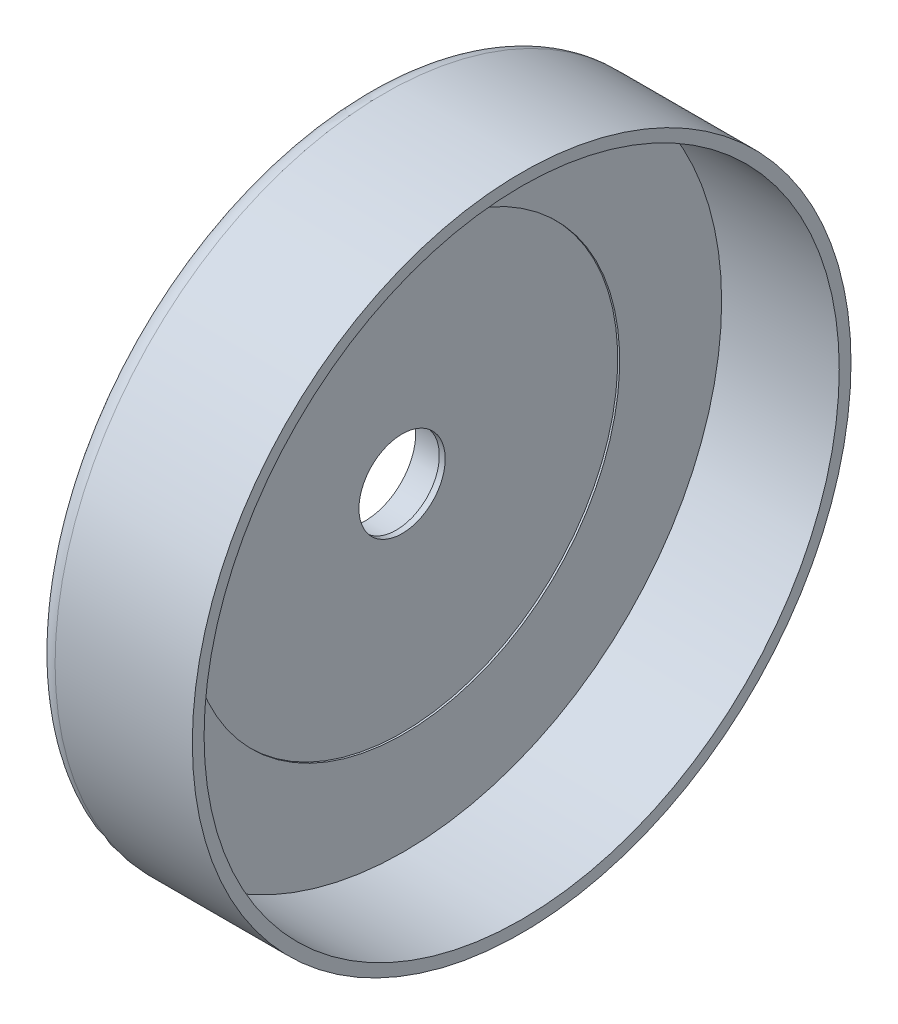
ISO-10303-21;
HEADER;
FILE_DESCRIPTION(('STEP AP214'),'2;1');
FILE_NAME('part.step','',(''),(''),'','','');
FILE_SCHEMA(('AUTOMOTIVE_DESIGN { 1 0 10303 214 1 1 1 1 }'));
ENDSEC;
DATA;
#1=APPLICATION_CONTEXT('core data for automotive mechanical design processes');
#2=APPLICATION_PROTOCOL_DEFINITION('international standard','automotive_design',2000,#1);
#3=PRODUCT_CONTEXT('',#1,'mechanical');
#4=PRODUCT('Part','Part','',(#3));
#5=PRODUCT_RELATED_PRODUCT_CATEGORY('part','',(#4));
#6=PRODUCT_DEFINITION_FORMATION('','',#4);
#7=PRODUCT_DEFINITION_CONTEXT('part definition',#1,'design');
#8=PRODUCT_DEFINITION('design','',#6,#7);
#9=PRODUCT_DEFINITION_SHAPE('','',#8);
#10=(LENGTH_UNIT() NAMED_UNIT(*) SI_UNIT(.MILLI.,.METRE.));
#11=(NAMED_UNIT(*) PLANE_ANGLE_UNIT() SI_UNIT($,.RADIAN.));
#12=(NAMED_UNIT(*) SI_UNIT($,.STERADIAN.) SOLID_ANGLE_UNIT());
#13=UNCERTAINTY_MEASURE_WITH_UNIT(LENGTH_MEASURE(1.E-05),#10,'distance_accuracy_value','');
#14=(GEOMETRIC_REPRESENTATION_CONTEXT(3) GLOBAL_UNCERTAINTY_ASSIGNED_CONTEXT((#13)) GLOBAL_UNIT_ASSIGNED_CONTEXT((#10,
#11,#12)) REPRESENTATION_CONTEXT('',''));
#15=CARTESIAN_POINT('',(0.,0.,0.));
#16=DIRECTION('',(0.,0.,1.));
#17=DIRECTION('',(1.,0.,0.));
#18=AXIS2_PLACEMENT_3D('',#15,#16,#17);
#19=CARTESIAN_POINT('',(30.,0.,0.));
#20=DIRECTION('',(-1.,0.,0.));
#21=DIRECTION('',(0.,0.,1.));
#22=AXIS2_PLACEMENT_3D('',#19,#20,#21);
#23=CYLINDRICAL_SURFACE('',#22,11.);
#24=CARTESIAN_POINT('',(-0.5,0.,0.));
#25=DIRECTION('',(1.,0.,0.));
#26=DIRECTION('',(0.,0.,-1.));
#27=AXIS2_PLACEMENT_3D('',#24,#25,#26);
#28=CIRCLE('',#27,11.);
#29=CARTESIAN_POINT('',(-0.5,0.,-11.));
#30=VERTEX_POINT('',#29);
#31=EDGE_CURVE('E47',#30,#30,#28,.F.);
#32=ORIENTED_EDGE('',*,*,#31,.F.);
#33=EDGE_LOOP('',(#32));
#34=FACE_BOUND('',#33,.T.);
#35=CARTESIAN_POINT('',(-2.00000000000001,0.,0.));
#36=DIRECTION('',(-1.,0.,0.));
#37=DIRECTION('',(0.,0.,1.));
#38=AXIS2_PLACEMENT_3D('',#35,#36,#37);
#39=CIRCLE('',#38,11.);
#40=CARTESIAN_POINT('',(-2.00000000000001,0.,11.));
#41=VERTEX_POINT('',#40);
#42=EDGE_CURVE('E35',#41,#41,#39,.F.);
#43=ORIENTED_EDGE('',*,*,#42,.F.);
#44=EDGE_LOOP('',(#43));
#45=FACE_BOUND('',#44,.T.);
#46=ADVANCED_FACE('F31',(#34,#45),#23,.F.);
#47=CARTESIAN_POINT('',(0.,0.,0.));
#48=DIRECTION('',(-1.,0.,0.));
#49=DIRECTION('',(0.,0.,1.));
#50=AXIS2_PLACEMENT_3D('',#47,#48,#49);
#51=PLANE('',#50);
#52=CARTESIAN_POINT('',(0.,0.,0.));
#53=DIRECTION('',(-1.,0.,0.));
#54=DIRECTION('',(0.,0.,1.));
#55=AXIS2_PLACEMENT_3D('',#52,#53,#54);
#56=CIRCLE('',#55,55.);
#57=CARTESIAN_POINT('',(0.,0.,55.));
#58=VERTEX_POINT('',#57);
#59=EDGE_CURVE('E57',#58,#58,#56,.T.);
#60=ORIENTED_EDGE('',*,*,#59,.T.);
#61=EDGE_LOOP('',(#60));
#62=FACE_BOUND('',#61,.T.);
#63=CARTESIAN_POINT('',(0.,0.,0.));
#64=DIRECTION('',(-1.,0.,0.));
#65=DIRECTION('',(0.,0.,1.));
#66=AXIS2_PLACEMENT_3D('',#63,#64,#65);
#67=CIRCLE('',#66,81.);
#68=CARTESIAN_POINT('',(0.,0.,81.));
#69=VERTEX_POINT('',#68);
#70=EDGE_CURVE('E44',#69,#69,#67,.T.);
#71=ORIENTED_EDGE('',*,*,#70,.F.);
#72=EDGE_LOOP('',(#71));
#73=FACE_BOUND('',#72,.T.);
#74=ADVANCED_FACE('F71',(#62,#73),#51,.F.);
#75=CARTESIAN_POINT('',(-10.,0.,0.));
#76=DIRECTION('',(-1.,0.,0.));
#77=DIRECTION('',(0.,0.,1.));
#78=AXIS2_PLACEMENT_3D('',#75,#76,#77);
#79=CYLINDRICAL_SURFACE('',#78,81.);
#80=CARTESIAN_POINT('',(30.,0.,0.));
#81=DIRECTION('',(-1.,0.,0.));
#82=DIRECTION('',(0.,0.,1.));
#83=AXIS2_PLACEMENT_3D('',#80,#81,#82);
#84=CIRCLE('',#83,81.);
#85=CARTESIAN_POINT('',(30.,0.,81.));
#86=VERTEX_POINT('',#85);
#87=EDGE_CURVE('E54',#86,#86,#84,.T.);
#88=ORIENTED_EDGE('',*,*,#87,.F.);
#89=EDGE_LOOP('',(#88));
#90=FACE_BOUND('',#89,.T.);
#91=ORIENTED_EDGE('',*,*,#70,.T.);
#92=EDGE_LOOP('',(#91));
#93=FACE_BOUND('',#92,.T.);
#94=ADVANCED_FACE('F69',(#90,#93),#79,.F.);
#95=CARTESIAN_POINT('',(30.,81.,0.));
#96=DIRECTION('',(-1.,0.,0.));
#97=DIRECTION('',(0.,0.,1.));
#98=AXIS2_PLACEMENT_3D('',#95,#96,#97);
#99=PLANE('',#98);
#100=CARTESIAN_POINT('',(30.,0.,0.));
#101=DIRECTION('',(-1.,0.,0.));
#102=DIRECTION('',(0.,0.,1.));
#103=AXIS2_PLACEMENT_3D('',#100,#101,#102);
#104=CIRCLE('',#103,84.);
#105=CARTESIAN_POINT('',(30.,0.,84.));
#106=VERTEX_POINT('',#105);
#107=EDGE_CURVE('E49',#106,#106,#104,.T.);
#108=ORIENTED_EDGE('',*,*,#107,.F.);
#109=EDGE_LOOP('',(#108));
#110=FACE_BOUND('',#109,.T.);
#111=ORIENTED_EDGE('',*,*,#87,.T.);
#112=EDGE_LOOP('',(#111));
#113=FACE_BOUND('',#112,.T.);
#114=ADVANCED_FACE('F78',(#110,#113),#99,.F.);
#115=CARTESIAN_POINT('',(-10.,0.,0.));
#116=DIRECTION('',(-1.,0.,0.));
#117=DIRECTION('',(0.,0.,1.));
#118=AXIS2_PLACEMENT_3D('',#115,#116,#117);
#119=CYLINDRICAL_SURFACE('',#118,84.);
#120=CARTESIAN_POINT('',(-5.00000000000001,0.,0.));
#121=DIRECTION('',(1.,0.,0.));
#122=DIRECTION('',(0.,0.,-1.));
#123=AXIS2_PLACEMENT_3D('',#120,#121,#122);
#124=CIRCLE('',#123,84.);
#125=CARTESIAN_POINT('',(-5.00000000000001,0.,-84.));
#126=VERTEX_POINT('',#125);
#127=EDGE_CURVE('E10',#126,#126,#124,.T.);
#128=ORIENTED_EDGE('',*,*,#127,.T.);
#129=EDGE_LOOP('',(#128));
#130=FACE_BOUND('',#129,.T.);
#131=ORIENTED_EDGE('',*,*,#107,.T.);
#132=EDGE_LOOP('',(#131));
#133=FACE_BOUND('',#132,.T.);
#134=ADVANCED_FACE('F86',(#130,#133),#119,.T.);
#135=CARTESIAN_POINT('',(-10.,84.,0.));
#136=DIRECTION('',(1.,0.,0.));
#137=DIRECTION('',(0.,0.,-1.));
#138=AXIS2_PLACEMENT_3D('',#135,#136,#137);
#139=PLANE('',#138);
#140=CARTESIAN_POINT('',(-10.,0.,0.));
#141=DIRECTION('',(-1.,0.,0.));
#142=DIRECTION('',(0.,0.,1.));
#143=AXIS2_PLACEMENT_3D('',#140,#141,#142);
#144=CIRCLE('',#143,13.);
#145=CARTESIAN_POINT('',(-10.,0.,13.));
#146=VERTEX_POINT('',#145);
#147=EDGE_CURVE('E117',#146,#146,#144,.T.);
#148=ORIENTED_EDGE('',*,*,#147,.F.);
#149=EDGE_LOOP('',(#148));
#150=FACE_BOUND('',#149,.T.);
#151=CARTESIAN_POINT('',(-10.,0.,0.));
#152=DIRECTION('',(1.,0.,0.));
#153=DIRECTION('',(0.,0.,-1.));
#154=AXIS2_PLACEMENT_3D('',#151,#152,#153);
#155=CIRCLE('',#154,79.);
#156=CARTESIAN_POINT('',(-10.,0.,-79.));
#157=VERTEX_POINT('',#156);
#158=EDGE_CURVE('E39',#157,#157,#155,.F.);
#159=ORIENTED_EDGE('',*,*,#158,.T.);
#160=EDGE_LOOP('',(#159));
#161=FACE_BOUND('',#160,.T.);
#162=ADVANCED_FACE('F90',(#150,#161),#139,.F.);
#163=CARTESIAN_POINT('',(-5.00000000000001,0.,0.));
#164=DIRECTION('',(1.,0.,0.));
#165=DIRECTION('',(0.,0.,-1.));
#166=AXIS2_PLACEMENT_3D('',#163,#164,#165);
#167=TOROIDAL_SURFACE('',#166,79.,5.);
#168=ORIENTED_EDGE('',*,*,#127,.F.);
#169=EDGE_LOOP('',(#168));
#170=FACE_BOUND('',#169,.T.);
#171=ORIENTED_EDGE('',*,*,#158,.F.);
#172=EDGE_LOOP('',(#171));
#173=FACE_BOUND('',#172,.T.);
#174=ADVANCED_FACE('F33',(#170,#173),#167,.T.);
#175=CARTESIAN_POINT('',(-0.5,0.,0.));
#176=DIRECTION('',(1.,0.,0.));
#177=DIRECTION('',(0.,0.,-1.));
#178=AXIS2_PLACEMENT_3D('',#175,#176,#177);
#179=PLANE('',#178);
#180=CARTESIAN_POINT('',(-0.5,0.,0.));
#181=DIRECTION('',(-1.,0.,0.));
#182=DIRECTION('',(0.,0.,1.));
#183=AXIS2_PLACEMENT_3D('',#180,#181,#182);
#184=CIRCLE('',#183,55.);
#185=CARTESIAN_POINT('',(-0.5,0.,55.));
#186=VERTEX_POINT('',#185);
#187=EDGE_CURVE('E50',#186,#186,#184,.T.);
#188=ORIENTED_EDGE('',*,*,#187,.F.);
#189=EDGE_LOOP('',(#188));
#190=FACE_BOUND('',#189,.T.);
#191=ORIENTED_EDGE('',*,*,#31,.T.);
#192=EDGE_LOOP('',(#191));
#193=FACE_BOUND('',#192,.T.);
#194=ADVANCED_FACE('F94',(#190,#193),#179,.T.);
#195=CARTESIAN_POINT('',(-10.,0.,0.));
#196=DIRECTION('',(-1.,0.,0.));
#197=DIRECTION('',(0.,0.,1.));
#198=AXIS2_PLACEMENT_3D('',#195,#196,#197);
#199=CYLINDRICAL_SURFACE('',#198,55.);
#200=ORIENTED_EDGE('',*,*,#187,.T.);
#201=EDGE_LOOP('',(#200));
#202=FACE_BOUND('',#201,.T.);
#203=ORIENTED_EDGE('',*,*,#59,.F.);
#204=EDGE_LOOP('',(#203));
#205=FACE_BOUND('',#204,.T.);
#206=ADVANCED_FACE('F97',(#202,#205),#199,.F.);
#207=CARTESIAN_POINT('',(-2.00000000000001,0.,0.));
#208=DIRECTION('',(-1.,0.,0.));
#209=DIRECTION('',(0.,0.,1.));
#210=AXIS2_PLACEMENT_3D('',#207,#208,#209);
#211=PLANE('',#210);
#212=CARTESIAN_POINT('',(-2.00000000000001,0.,0.));
#213=DIRECTION('',(-1.,0.,0.));
#214=DIRECTION('',(0.,0.,1.));
#215=AXIS2_PLACEMENT_3D('',#212,#213,#214);
#216=CIRCLE('',#215,13.);
#217=CARTESIAN_POINT('',(-2.00000000000001,0.,13.));
#218=VERTEX_POINT('',#217);
#219=EDGE_CURVE('E113',#218,#218,#216,.T.);
#220=ORIENTED_EDGE('',*,*,#219,.T.);
#221=EDGE_LOOP('',(#220));
#222=FACE_BOUND('',#221,.T.);
#223=ORIENTED_EDGE('',*,*,#42,.T.);
#224=EDGE_LOOP('',(#223));
#225=FACE_BOUND('',#224,.T.);
#226=ADVANCED_FACE('F101',(#222,#225),#211,.T.);
#227=CARTESIAN_POINT('',(-2.00000000000001,0.,0.));
#228=DIRECTION('',(-1.,0.,0.));
#229=DIRECTION('',(0.,0.,1.));
#230=AXIS2_PLACEMENT_3D('',#227,#228,#229);
#231=CYLINDRICAL_SURFACE('',#230,13.);
#232=ORIENTED_EDGE('',*,*,#219,.F.);
#233=EDGE_LOOP('',(#232));
#234=FACE_BOUND('',#233,.T.);
#235=ORIENTED_EDGE('',*,*,#147,.T.);
#236=EDGE_LOOP('',(#235));
#237=FACE_BOUND('',#236,.T.);
#238=ADVANCED_FACE('F102',(#234,#237),#231,.F.);
#239=CLOSED_SHELL('',(#46,#74,#94,#114,#134,#162,#174,#194,#206,#226,#238));
#240=MANIFOLD_SOLID_BREP('B2',#239);
#241=ADVANCED_BREP_SHAPE_REPRESENTATION('',(#18,#240),#14);
#242=SHAPE_DEFINITION_REPRESENTATION(#9,#241);
ENDSEC;
END-ISO-10303-21;
